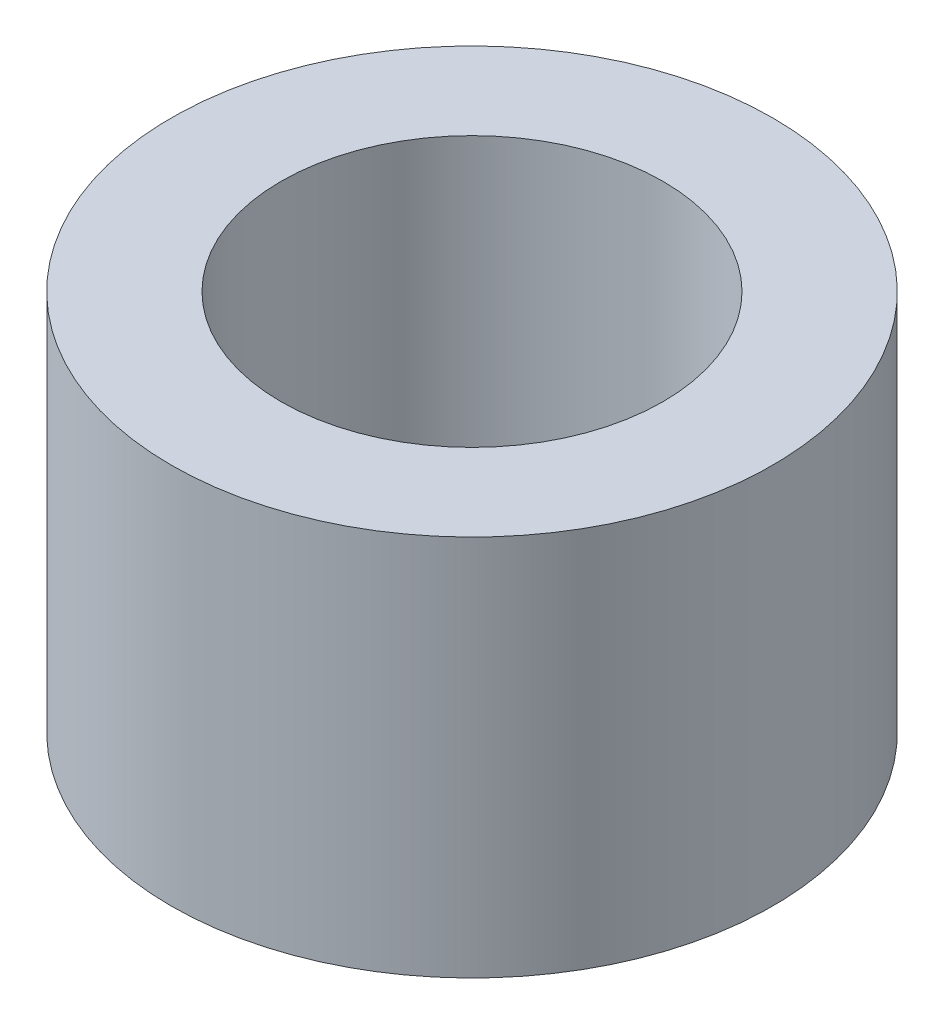
ISO-10303-21;
HEADER;
FILE_DESCRIPTION(('STEP AP214'),'2;1');
FILE_NAME('part.step','',(''),(''),'','','');
FILE_SCHEMA(('AUTOMOTIVE_DESIGN { 1 0 10303 214 1 1 1 1 }'));
ENDSEC;
DATA;
#1=APPLICATION_CONTEXT('core data for automotive mechanical design processes');
#2=APPLICATION_PROTOCOL_DEFINITION('international standard','automotive_design',2000,#1);
#3=PRODUCT_CONTEXT('',#1,'mechanical');
#4=PRODUCT('Part','Part','',(#3));
#5=PRODUCT_RELATED_PRODUCT_CATEGORY('part','',(#4));
#6=PRODUCT_DEFINITION_FORMATION('','',#4);
#7=PRODUCT_DEFINITION_CONTEXT('part definition',#1,'design');
#8=PRODUCT_DEFINITION('design','',#6,#7);
#9=PRODUCT_DEFINITION_SHAPE('','',#8);
#10=(LENGTH_UNIT() NAMED_UNIT(*) SI_UNIT(.MILLI.,.METRE.));
#11=(NAMED_UNIT(*) PLANE_ANGLE_UNIT() SI_UNIT($,.RADIAN.));
#12=(NAMED_UNIT(*) SI_UNIT($,.STERADIAN.) SOLID_ANGLE_UNIT());
#13=UNCERTAINTY_MEASURE_WITH_UNIT(LENGTH_MEASURE(1.E-05),#10,'distance_accuracy_value','');
#14=(GEOMETRIC_REPRESENTATION_CONTEXT(3) GLOBAL_UNCERTAINTY_ASSIGNED_CONTEXT((#13)) GLOBAL_UNIT_ASSIGNED_CONTEXT((#10,
#11,#12)) REPRESENTATION_CONTEXT('',''));
#15=CARTESIAN_POINT('',(0.,0.,0.));
#16=DIRECTION('',(0.,0.,1.));
#17=DIRECTION('',(1.,0.,0.));
#18=AXIS2_PLACEMENT_3D('',#15,#16,#17);
#19=CARTESIAN_POINT('',(2.,4.,0.));
#20=DIRECTION('',(0.,1.,0.));
#21=DIRECTION('',(0.,0.,-1.));
#22=AXIS2_PLACEMENT_3D('',#19,#20,#21);
#23=PLANE('',#22);
#24=CARTESIAN_POINT('',(0.,4.,0.));
#25=DIRECTION('',(0.,1.,0.));
#26=DIRECTION('',(0.,0.,1.));
#27=AXIS2_PLACEMENT_3D('',#24,#25,#26);
#28=CIRCLE('',#27,2.);
#29=CARTESIAN_POINT('',(0.,4.,2.));
#30=VERTEX_POINT('',#29);
#31=EDGE_CURVE('E48',#30,#30,#28,.T.);
#32=ORIENTED_EDGE('',*,*,#31,.F.);
#33=EDGE_LOOP('',(#32));
#34=FACE_BOUND('',#33,.T.);
#35=CARTESIAN_POINT('',(0.,4.,0.));
#36=DIRECTION('',(0.,1.,0.));
#37=DIRECTION('',(0.,0.,1.));
#38=AXIS2_PLACEMENT_3D('',#35,#36,#37);
#39=CIRCLE('',#38,3.15);
#40=CARTESIAN_POINT('',(0.,4.,3.15));
#41=VERTEX_POINT('',#40);
#42=EDGE_CURVE('E10',#41,#41,#39,.T.);
#43=ORIENTED_EDGE('',*,*,#42,.T.);
#44=EDGE_LOOP('',(#43));
#45=FACE_BOUND('',#44,.T.);
#46=ADVANCED_FACE('F34',(#34,#45),#23,.T.);
#47=CARTESIAN_POINT('',(0.,0.,0.));
#48=DIRECTION('',(0.,-1.,0.));
#49=DIRECTION('',(0.,0.,1.));
#50=AXIS2_PLACEMENT_3D('',#47,#48,#49);
#51=CYLINDRICAL_SURFACE('',#50,3.15);
#52=ORIENTED_EDGE('',*,*,#42,.F.);
#53=EDGE_LOOP('',(#52));
#54=FACE_BOUND('',#53,.T.);
#55=CARTESIAN_POINT('',(0.,0.,0.));
#56=DIRECTION('',(0.,1.,0.));
#57=DIRECTION('',(0.,0.,1.));
#58=AXIS2_PLACEMENT_3D('',#55,#56,#57);
#59=CIRCLE('',#58,3.15);
#60=CARTESIAN_POINT('',(0.,0.,3.15));
#61=VERTEX_POINT('',#60);
#62=EDGE_CURVE('E40',#61,#61,#59,.T.);
#63=ORIENTED_EDGE('',*,*,#62,.T.);
#64=EDGE_LOOP('',(#63));
#65=FACE_BOUND('',#64,.T.);
#66=ADVANCED_FACE('F57',(#54,#65),#51,.T.);
#67=CARTESIAN_POINT('',(3.15,0.,0.));
#68=DIRECTION('',(0.,-1.,0.));
#69=DIRECTION('',(0.,0.,1.));
#70=AXIS2_PLACEMENT_3D('',#67,#68,#69);
#71=PLANE('',#70);
#72=ORIENTED_EDGE('',*,*,#62,.F.);
#73=EDGE_LOOP('',(#72));
#74=FACE_BOUND('',#73,.T.);
#75=CARTESIAN_POINT('',(0.,0.,0.));
#76=DIRECTION('',(0.,1.,0.));
#77=DIRECTION('',(0.,0.,1.));
#78=AXIS2_PLACEMENT_3D('',#75,#76,#77);
#79=CIRCLE('',#78,2.);
#80=CARTESIAN_POINT('',(0.,0.,2.));
#81=VERTEX_POINT('',#80);
#82=EDGE_CURVE('E44',#81,#81,#79,.T.);
#83=ORIENTED_EDGE('',*,*,#82,.T.);
#84=EDGE_LOOP('',(#83));
#85=FACE_BOUND('',#84,.T.);
#86=ADVANCED_FACE('F61',(#74,#85),#71,.T.);
#87=CARTESIAN_POINT('',(0.,0.,0.));
#88=DIRECTION('',(0.,-1.,0.));
#89=DIRECTION('',(0.,0.,1.));
#90=AXIS2_PLACEMENT_3D('',#87,#88,#89);
#91=CYLINDRICAL_SURFACE('',#90,2.);
#92=ORIENTED_EDGE('',*,*,#82,.F.);
#93=EDGE_LOOP('',(#92));
#94=FACE_BOUND('',#93,.T.);
#95=ORIENTED_EDGE('',*,*,#31,.T.);
#96=EDGE_LOOP('',(#95));
#97=FACE_BOUND('',#96,.T.);
#98=ADVANCED_FACE('F54',(#94,#97),#91,.F.);
#99=CLOSED_SHELL('',(#46,#66,#86,#98));
#100=MANIFOLD_SOLID_BREP('B2',#99);
#101=ADVANCED_BREP_SHAPE_REPRESENTATION('',(#18,#100),#14);
#102=SHAPE_DEFINITION_REPRESENTATION(#9,#101);
ENDSEC;
END-ISO-10303-21;
